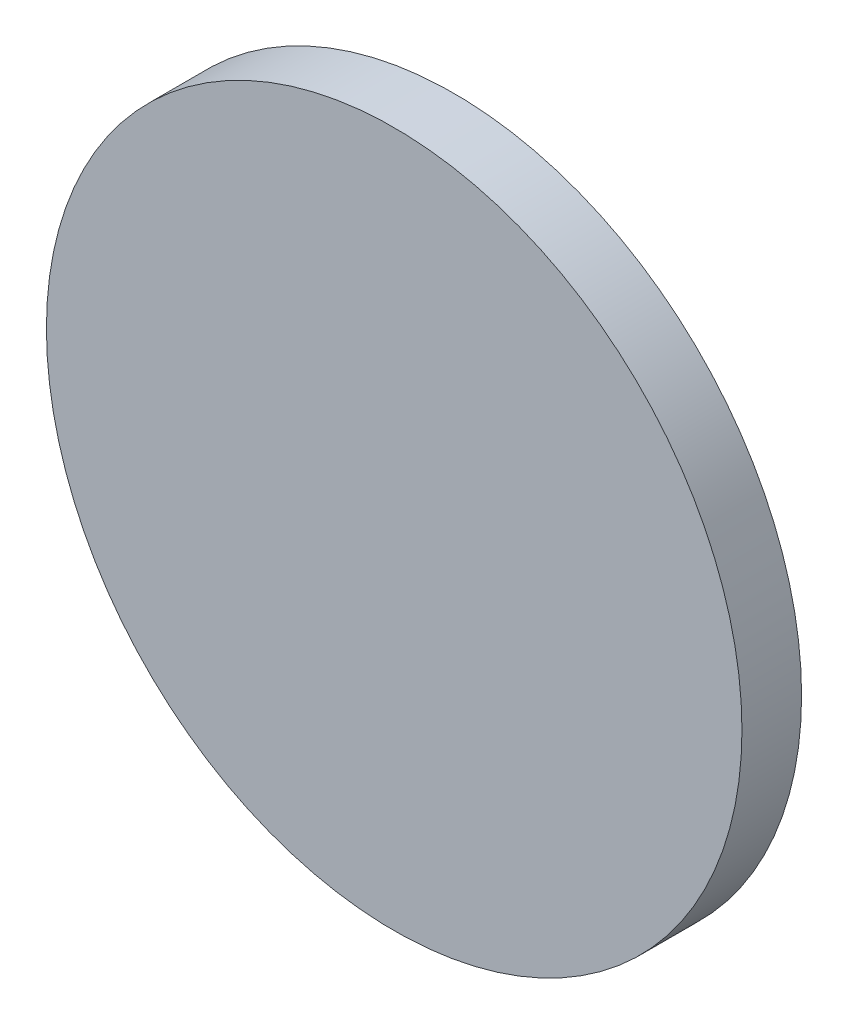
ISO-10303-21;
HEADER;
FILE_DESCRIPTION(('STEP AP214'),'2;1');
FILE_NAME('part.step','',(''),(''),'','','');
FILE_SCHEMA(('AUTOMOTIVE_DESIGN { 1 0 10303 214 1 1 1 1 }'));
ENDSEC;
DATA;
#1=APPLICATION_CONTEXT('core data for automotive mechanical design processes');
#2=APPLICATION_PROTOCOL_DEFINITION('international standard','automotive_design',2000,#1);
#3=PRODUCT_CONTEXT('',#1,'mechanical');
#4=PRODUCT('Part','Part','',(#3));
#5=PRODUCT_RELATED_PRODUCT_CATEGORY('part','',(#4));
#6=PRODUCT_DEFINITION_FORMATION('','',#4);
#7=PRODUCT_DEFINITION_CONTEXT('part definition',#1,'design');
#8=PRODUCT_DEFINITION('design','',#6,#7);
#9=PRODUCT_DEFINITION_SHAPE('','',#8);
#10=(LENGTH_UNIT() NAMED_UNIT(*) SI_UNIT(.MILLI.,.METRE.));
#11=(NAMED_UNIT(*) PLANE_ANGLE_UNIT() SI_UNIT($,.RADIAN.));
#12=(NAMED_UNIT(*) SI_UNIT($,.STERADIAN.) SOLID_ANGLE_UNIT());
#13=UNCERTAINTY_MEASURE_WITH_UNIT(LENGTH_MEASURE(1.E-05),#10,'distance_accuracy_value','');
#14=(GEOMETRIC_REPRESENTATION_CONTEXT(3) GLOBAL_UNCERTAINTY_ASSIGNED_CONTEXT((#13)) GLOBAL_UNIT_ASSIGNED_CONTEXT((#10,
#11,#12)) REPRESENTATION_CONTEXT('',''));
#15=CARTESIAN_POINT('',(0.,0.,0.));
#16=DIRECTION('',(0.,0.,1.));
#17=DIRECTION('',(1.,0.,0.));
#18=AXIS2_PLACEMENT_3D('',#15,#16,#17);
#19=CARTESIAN_POINT('',(3.8481,4.597400006176,0.79916));
#20=DIRECTION('',(0.,0.,1.));
#21=DIRECTION('',(1.,0.,0.));
#22=AXIS2_PLACEMENT_3D('',#19,#20,#21);
#23=PLANE('',#22);
#24=CARTESIAN_POINT('',(3.8481,4.597400006176,0.79916));
#25=DIRECTION('',(0.,0.,1.));
#26=DIRECTION('',(1.,0.,0.));
#27=AXIS2_PLACEMENT_3D('',#24,#25,#26);
#28=CIRCLE('',#27,0.200024667);
#29=CARTESIAN_POINT('',(4.048124667,4.597400006176,0.79916));
#30=VERTEX_POINT('',#29);
#31=EDGE_CURVE('E18',#30,#30,#28,.F.);
#32=ORIENTED_EDGE('',*,*,#31,.F.);
#33=EDGE_LOOP('',(#32));
#34=FACE_BOUND('',#33,.T.);
#35=ADVANCED_FACE('F15',(#34),#23,.T.);
#36=CARTESIAN_POINT('',(3.8481,4.597400006176,0.76487));
#37=DIRECTION('',(0.,0.,1.));
#38=DIRECTION('',(1.,0.,0.));
#39=AXIS2_PLACEMENT_3D('',#36,#37,#38);
#40=CYLINDRICAL_SURFACE('',#39,0.200024667);
#41=ORIENTED_EDGE('',*,*,#31,.T.);
#42=EDGE_LOOP('',(#41));
#43=FACE_BOUND('',#42,.T.);
#44=CARTESIAN_POINT('',(3.8481,4.597400006176,0.76487));
#45=DIRECTION('',(0.,0.,1.));
#46=DIRECTION('',(1.,0.,0.));
#47=AXIS2_PLACEMENT_3D('',#44,#45,#46);
#48=CIRCLE('',#47,0.200024667);
#49=CARTESIAN_POINT('',(4.048124667,4.597400006176,0.76487));
#50=VERTEX_POINT('',#49);
#51=EDGE_CURVE('E10',#50,#50,#48,.F.);
#52=ORIENTED_EDGE('',*,*,#51,.F.);
#53=EDGE_LOOP('',(#52));
#54=FACE_BOUND('',#53,.T.);
#55=ADVANCED_FACE('F27',(#43,#54),#40,.T.);
#56=CARTESIAN_POINT('',(3.8481,4.597400006176,0.76487));
#57=DIRECTION('',(0.,0.,-1.));
#58=DIRECTION('',(-1.,0.,0.));
#59=AXIS2_PLACEMENT_3D('',#56,#57,#58);
#60=PLANE('',#59);
#61=ORIENTED_EDGE('',*,*,#51,.T.);
#62=EDGE_LOOP('',(#61));
#63=FACE_BOUND('',#62,.T.);
#64=ADVANCED_FACE('F35',(#63),#60,.T.);
#65=CLOSED_SHELL('',(#35,#55,#64));
#66=MANIFOLD_SOLID_BREP('B1',#65);
#67=ADVANCED_BREP_SHAPE_REPRESENTATION('',(#18,#66),#14);
#68=SHAPE_DEFINITION_REPRESENTATION(#9,#67);
ENDSEC;
END-ISO-10303-21;
